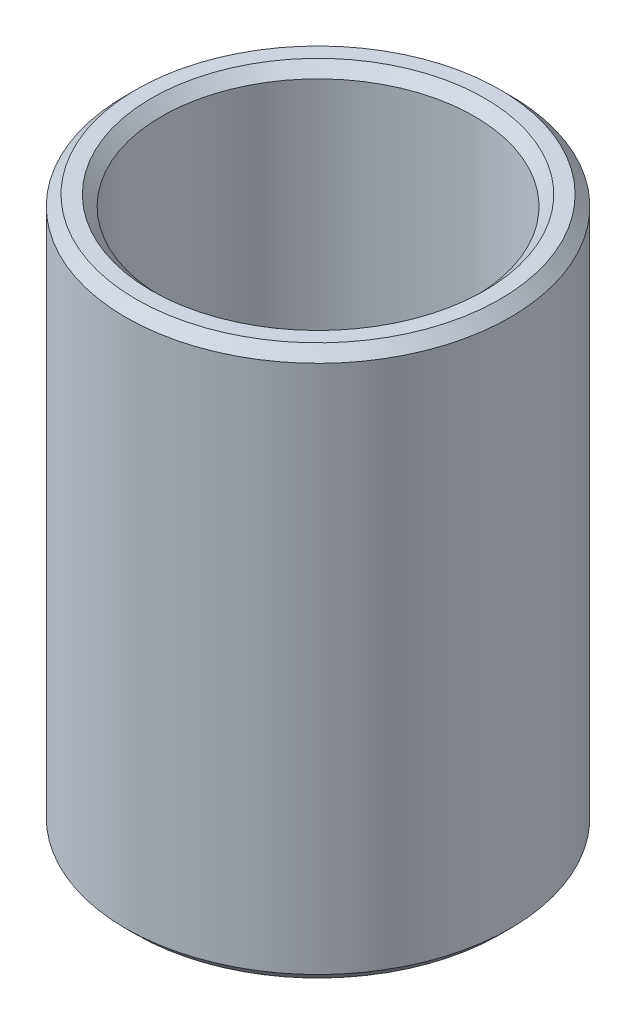
ISO-10303-21;
HEADER;
FILE_DESCRIPTION(('STEP AP214'),'2;1');
FILE_NAME('part.step','',(''),(''),'','','');
FILE_SCHEMA(('AUTOMOTIVE_DESIGN { 1 0 10303 214 1 1 1 1 }'));
ENDSEC;
DATA;
#1=APPLICATION_CONTEXT('core data for automotive mechanical design processes');
#2=APPLICATION_PROTOCOL_DEFINITION('international standard','automotive_design',2000,#1);
#3=PRODUCT_CONTEXT('',#1,'mechanical');
#4=PRODUCT('Part','Part','',(#3));
#5=PRODUCT_RELATED_PRODUCT_CATEGORY('part','',(#4));
#6=PRODUCT_DEFINITION_FORMATION('','',#4);
#7=PRODUCT_DEFINITION_CONTEXT('part definition',#1,'design');
#8=PRODUCT_DEFINITION('design','',#6,#7);
#9=PRODUCT_DEFINITION_SHAPE('','',#8);
#10=(LENGTH_UNIT() NAMED_UNIT(*) SI_UNIT(.MILLI.,.METRE.));
#11=(NAMED_UNIT(*) PLANE_ANGLE_UNIT() SI_UNIT($,.RADIAN.));
#12=(NAMED_UNIT(*) SI_UNIT($,.STERADIAN.) SOLID_ANGLE_UNIT());
#13=UNCERTAINTY_MEASURE_WITH_UNIT(LENGTH_MEASURE(1.E-05),#10,'distance_accuracy_value','');
#14=(GEOMETRIC_REPRESENTATION_CONTEXT(3) GLOBAL_UNCERTAINTY_ASSIGNED_CONTEXT((#13)) GLOBAL_UNIT_ASSIGNED_CONTEXT((#10,
#11,#12)) REPRESENTATION_CONTEXT('',''));
#15=CARTESIAN_POINT('',(0.,0.,0.));
#16=DIRECTION('',(0.,0.,1.));
#17=DIRECTION('',(1.,0.,0.));
#18=AXIS2_PLACEMENT_3D('',#15,#16,#17);
#19=CARTESIAN_POINT('',(0.,42.9359154998782,0.));
#20=DIRECTION('',(0.,-1.,0.));
#21=DIRECTION('',(0.,0.,-1.));
#22=AXIS2_PLACEMENT_3D('',#19,#20,#21);
#23=CYLINDRICAL_SURFACE('',#22,15.);
#24=CARTESIAN_POINT('',(0.,0.812536463036868,0.));
#25=DIRECTION('',(0.,1.,0.));
#26=DIRECTION('',(0.,0.,1.));
#27=AXIS2_PLACEMENT_3D('',#24,#25,#26);
#28=CIRCLE('',#27,15.);
#29=CARTESIAN_POINT('',(0.,0.812536463036868,15.));
#30=VERTEX_POINT('',#29);
#31=EDGE_CURVE('E10',#30,#30,#28,.T.);
#32=ORIENTED_EDGE('',*,*,#31,.T.);
#33=EDGE_LOOP('',(#32));
#34=FACE_BOUND('',#33,.T.);
#35=CARTESIAN_POINT('',(0.,42.1233790368413,0.));
#36=DIRECTION('',(0.,1.,0.));
#37=DIRECTION('',(0.,0.,1.));
#38=AXIS2_PLACEMENT_3D('',#35,#36,#37);
#39=CIRCLE('',#38,15.);
#40=CARTESIAN_POINT('',(0.,42.1233790368413,15.));
#41=VERTEX_POINT('',#40);
#42=EDGE_CURVE('E50',#41,#41,#39,.F.);
#43=ORIENTED_EDGE('',*,*,#42,.T.);
#44=EDGE_LOOP('',(#43));
#45=FACE_BOUND('',#44,.T.);
#46=ADVANCED_FACE('F39',(#34,#45),#23,.T.);
#47=CARTESIAN_POINT('',(0.,42.9359154998782,0.));
#48=DIRECTION('',(0.,1.,0.));
#49=DIRECTION('',(0.,0.,1.));
#50=AXIS2_PLACEMENT_3D('',#47,#48,#49);
#51=PLANE('',#50);
#52=CARTESIAN_POINT('',(0.,42.9359154998782,0.));
#53=DIRECTION('',(0.,1.,0.));
#54=DIRECTION('',(0.,0.,1.));
#55=AXIS2_PLACEMENT_3D('',#52,#53,#54);
#56=CIRCLE('',#55,13.0085927078916);
#57=CARTESIAN_POINT('',(0.,42.9359154998782,13.0085927078916));
#58=VERTEX_POINT('',#57);
#59=EDGE_CURVE('E58',#58,#58,#56,.F.);
#60=ORIENTED_EDGE('',*,*,#59,.T.);
#61=EDGE_LOOP('',(#60));
#62=FACE_BOUND('',#61,.T.);
#63=CARTESIAN_POINT('',(0.,42.9359154998782,0.));
#64=DIRECTION('',(0.,1.,0.));
#65=DIRECTION('',(0.,0.,1.));
#66=AXIS2_PLACEMENT_3D('',#63,#64,#65);
#67=CIRCLE('',#66,14.1874635369631);
#68=CARTESIAN_POINT('',(0.,42.9359154998782,14.1874635369631));
#69=VERTEX_POINT('',#68);
#70=EDGE_CURVE('E61',#69,#69,#67,.T.);
#71=ORIENTED_EDGE('',*,*,#70,.T.);
#72=EDGE_LOOP('',(#71));
#73=FACE_BOUND('',#72,.T.);
#74=ADVANCED_FACE('F88',(#62,#73),#51,.T.);
#75=CARTESIAN_POINT('',(0.,0.,0.));
#76=DIRECTION('',(0.,1.,0.));
#77=DIRECTION('',(0.,0.,1.));
#78=AXIS2_PLACEMENT_3D('',#75,#76,#77);
#79=PLANE('',#78);
#80=CARTESIAN_POINT('',(0.,0.,0.));
#81=DIRECTION('',(0.,1.,0.));
#82=DIRECTION('',(0.,0.,1.));
#83=AXIS2_PLACEMENT_3D('',#80,#81,#82);
#84=CIRCLE('',#83,13.0085927078916);
#85=CARTESIAN_POINT('',(0.,0.,13.0085927078916));
#86=VERTEX_POINT('',#85);
#87=EDGE_CURVE('E51',#86,#86,#84,.T.);
#88=ORIENTED_EDGE('',*,*,#87,.T.);
#89=EDGE_LOOP('',(#88));
#90=FACE_BOUND('',#89,.T.);
#91=CARTESIAN_POINT('',(0.,0.,0.));
#92=DIRECTION('',(0.,1.,0.));
#93=DIRECTION('',(0.,0.,1.));
#94=AXIS2_PLACEMENT_3D('',#91,#92,#93);
#95=CIRCLE('',#94,14.1874635369631);
#96=CARTESIAN_POINT('',(0.,0.,14.1874635369631));
#97=VERTEX_POINT('',#96);
#98=EDGE_CURVE('E54',#97,#97,#95,.F.);
#99=ORIENTED_EDGE('',*,*,#98,.T.);
#100=EDGE_LOOP('',(#99));
#101=FACE_BOUND('',#100,.T.);
#102=ADVANCED_FACE('F83',(#90,#101),#79,.F.);
#103=CARTESIAN_POINT('',(0.,42.9359154998782,0.));
#104=DIRECTION('',(0.,-1.,0.));
#105=DIRECTION('',(0.,0.,-1.));
#106=AXIS2_PLACEMENT_3D('',#103,#104,#105);
#107=CYLINDRICAL_SURFACE('',#106,12.1960562448547);
#108=CARTESIAN_POINT('',(0.,42.1233790368413,0.));
#109=DIRECTION('',(0.,1.,0.));
#110=DIRECTION('',(0.,0.,1.));
#111=AXIS2_PLACEMENT_3D('',#108,#109,#110);
#112=CIRCLE('',#111,12.1960562448547);
#113=CARTESIAN_POINT('',(0.,42.1233790368413,12.1960562448547));
#114=VERTEX_POINT('',#113);
#115=EDGE_CURVE('E67',#114,#114,#112,.T.);
#116=ORIENTED_EDGE('',*,*,#115,.T.);
#117=EDGE_LOOP('',(#116));
#118=FACE_BOUND('',#117,.T.);
#119=CARTESIAN_POINT('',(0.,0.812536463036875,0.));
#120=DIRECTION('',(0.,1.,0.));
#121=DIRECTION('',(0.,0.,1.));
#122=AXIS2_PLACEMENT_3D('',#119,#120,#121);
#123=CIRCLE('',#122,12.1960562448547);
#124=CARTESIAN_POINT('',(0.,0.812536463036875,12.1960562448547));
#125=VERTEX_POINT('',#124);
#126=EDGE_CURVE('E69',#125,#125,#123,.F.);
#127=ORIENTED_EDGE('',*,*,#126,.T.);
#128=EDGE_LOOP('',(#127));
#129=FACE_BOUND('',#128,.T.);
#130=ADVANCED_FACE('F71',(#118,#129),#107,.F.);
#131=CARTESIAN_POINT('',(0.,42.1233790368413,0.));
#132=DIRECTION('',(0.,1.,0.));
#133=DIRECTION('',(0.,0.,1.));
#134=AXIS2_PLACEMENT_3D('',#131,#132,#133);
#135=CONICAL_SURFACE('',#134,12.1960562448547,0.785398163397449);
#136=ORIENTED_EDGE('',*,*,#59,.F.);
#137=EDGE_LOOP('',(#136));
#138=FACE_BOUND('',#137,.T.);
#139=ORIENTED_EDGE('',*,*,#115,.F.);
#140=EDGE_LOOP('',(#139));
#141=FACE_BOUND('',#140,.T.);
#142=ADVANCED_FACE('F77',(#138,#141),#135,.F.);
#143=CARTESIAN_POINT('',(0.,0.,0.));
#144=DIRECTION('',(0.,-1.,0.));
#145=DIRECTION('',(0.,0.,-1.));
#146=AXIS2_PLACEMENT_3D('',#143,#144,#145);
#147=CONICAL_SURFACE('',#146,13.0085927078916,0.785398163397443);
#148=ORIENTED_EDGE('',*,*,#126,.F.);
#149=EDGE_LOOP('',(#148));
#150=FACE_BOUND('',#149,.T.);
#151=ORIENTED_EDGE('',*,*,#87,.F.);
#152=EDGE_LOOP('',(#151));
#153=FACE_BOUND('',#152,.T.);
#154=ADVANCED_FACE('F73',(#150,#153),#147,.F.);
#155=CARTESIAN_POINT('',(0.,0.812536463036868,0.));
#156=DIRECTION('',(0.,1.,0.));
#157=DIRECTION('',(0.,0.,1.));
#158=AXIS2_PLACEMENT_3D('',#155,#156,#157);
#159=CONICAL_SURFACE('',#158,15.,0.785398163397452);
#160=ORIENTED_EDGE('',*,*,#98,.F.);
#161=EDGE_LOOP('',(#160));
#162=FACE_BOUND('',#161,.T.);
#163=ORIENTED_EDGE('',*,*,#31,.F.);
#164=EDGE_LOOP('',(#163));
#165=FACE_BOUND('',#164,.T.);
#166=ADVANCED_FACE('F76',(#162,#165),#159,.T.);
#167=CARTESIAN_POINT('',(0.,42.9359154998782,0.));
#168=DIRECTION('',(0.,-1.,0.));
#169=DIRECTION('',(0.,0.,-1.));
#170=AXIS2_PLACEMENT_3D('',#167,#168,#169);
#171=CONICAL_SURFACE('',#170,14.1874635369631,0.785398163397444);
#172=ORIENTED_EDGE('',*,*,#42,.F.);
#173=EDGE_LOOP('',(#172));
#174=FACE_BOUND('',#173,.T.);
#175=ORIENTED_EDGE('',*,*,#70,.F.);
#176=EDGE_LOOP('',(#175));
#177=FACE_BOUND('',#176,.T.);
#178=ADVANCED_FACE('F45',(#174,#177),#171,.T.);
#179=CLOSED_SHELL('',(#46,#74,#102,#130,#142,#154,#166,#178));
#180=MANIFOLD_SOLID_BREP('B2',#179);
#181=ADVANCED_BREP_SHAPE_REPRESENTATION('',(#18,#180),#14);
#182=SHAPE_DEFINITION_REPRESENTATION(#9,#181);
ENDSEC;
END-ISO-10303-21;
